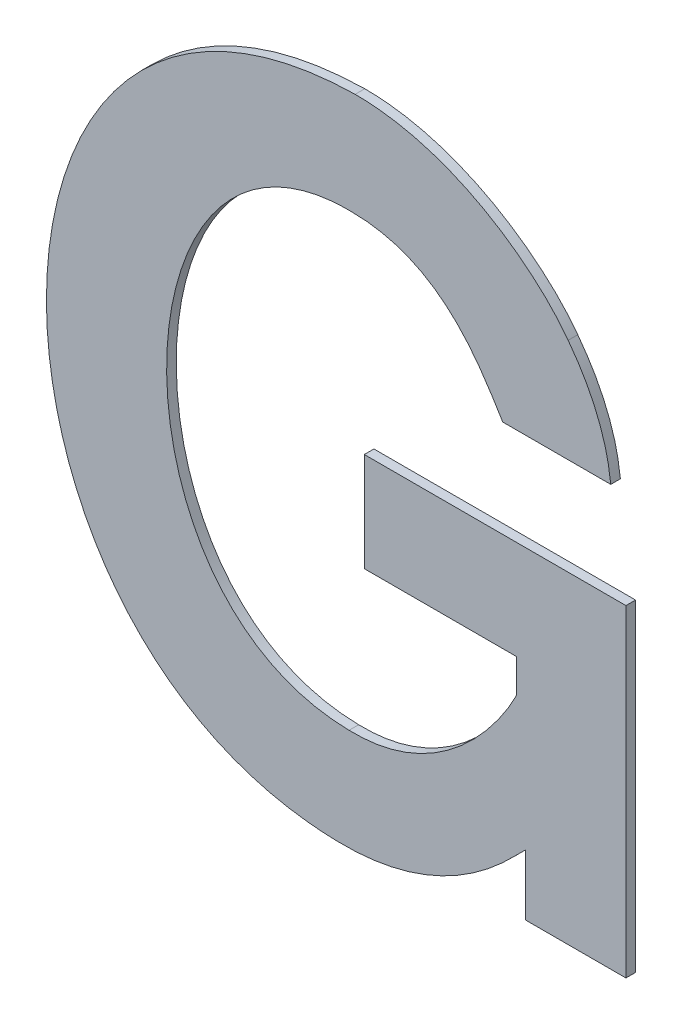
ISO-10303-21;
HEADER;
FILE_DESCRIPTION(('STEP AP214'),'2;1');
FILE_NAME('part.step','',(''),(''),'','','');
FILE_SCHEMA(('AUTOMOTIVE_DESIGN { 1 0 10303 214 1 1 1 1 }'));
ENDSEC;
DATA;
#1=APPLICATION_CONTEXT('core data for automotive mechanical design processes');
#2=APPLICATION_PROTOCOL_DEFINITION('international standard','automotive_design',2000,#1);
#3=PRODUCT_CONTEXT('',#1,'mechanical');
#4=PRODUCT('Part','Part','',(#3));
#5=PRODUCT_RELATED_PRODUCT_CATEGORY('part','',(#4));
#6=PRODUCT_DEFINITION_FORMATION('','',#4);
#7=PRODUCT_DEFINITION_CONTEXT('part definition',#1,'design');
#8=PRODUCT_DEFINITION('design','',#6,#7);
#9=PRODUCT_DEFINITION_SHAPE('','',#8);
#10=(LENGTH_UNIT() NAMED_UNIT(*) SI_UNIT(.MILLI.,.METRE.));
#11=(NAMED_UNIT(*) PLANE_ANGLE_UNIT() SI_UNIT($,.RADIAN.));
#12=(NAMED_UNIT(*) SI_UNIT($,.STERADIAN.) SOLID_ANGLE_UNIT());
#13=UNCERTAINTY_MEASURE_WITH_UNIT(LENGTH_MEASURE(1.E-05),#10,'distance_accuracy_value','');
#14=(GEOMETRIC_REPRESENTATION_CONTEXT(3) GLOBAL_UNCERTAINTY_ASSIGNED_CONTEXT((#13)) GLOBAL_UNIT_ASSIGNED_CONTEXT((#10,
#11,#12)) REPRESENTATION_CONTEXT('',''));
#15=CARTESIAN_POINT('',(0.,0.,0.));
#16=DIRECTION('',(0.,0.,1.));
#17=DIRECTION('',(1.,0.,0.));
#18=AXIS2_PLACEMENT_3D('',#15,#16,#17);
#19=CARTESIAN_POINT('',(3.9241251080488,-0.67256902519454,0.));
#20=DIRECTION('',(1.,0.,0.));
#21=DIRECTION('',(0.,1.,0.));
#22=AXIS2_PLACEMENT_3D('',#19,#20,#21);
#23=PLANE('',#22);
#24=DIRECTION('',(0.,1.,0.));
#25=VECTOR('',#24,1.);
#26=CARTESIAN_POINT('',(3.9241251080488,-0.67256902519454,0.));
#27=LINE('',#26,#25);
#28=CARTESIAN_POINT('',(3.9241251080488,-0.67256902519454,0.));
#29=VERTEX_POINT('',#28);
#30=CARTESIAN_POINT('',(3.9241251080488,-0.571980923701634,0.));
#31=VERTEX_POINT('',#30);
#32=EDGE_CURVE('E11',#29,#31,#27,.T.);
#33=ORIENTED_EDGE('',*,*,#32,.T.);
#34=DIRECTION('',(0.,0.,1.));
#35=VECTOR('',#34,1.);
#36=CARTESIAN_POINT('',(3.9241251080488,-0.571980923701634,0.));
#37=LINE('',#36,#35);
#38=CARTESIAN_POINT('',(3.9241251080488,-0.571980923701634,0.003));
#39=VERTEX_POINT('',#38);
#40=EDGE_CURVE('E24',#31,#39,#37,.T.);
#41=ORIENTED_EDGE('',*,*,#40,.T.);
#42=DIRECTION('',(0.,1.,0.));
#43=VECTOR('',#42,1.);
#44=CARTESIAN_POINT('',(3.9241251080488,-0.67256902519454,0.003));
#45=LINE('',#44,#43);
#46=CARTESIAN_POINT('',(3.9241251080488,-0.67256902519454,0.003));
#47=VERTEX_POINT('',#46);
#48=EDGE_CURVE('E142',#47,#39,#45,.T.);
#49=ORIENTED_EDGE('',*,*,#48,.F.);
#50=DIRECTION('',(0.,0.,1.));
#51=VECTOR('',#50,1.);
#52=CARTESIAN_POINT('',(3.9241251080488,-0.67256902519454,0.));
#53=LINE('',#52,#51);
#54=EDGE_CURVE('E443',#29,#47,#53,.T.);
#55=ORIENTED_EDGE('',*,*,#54,.F.);
#56=EDGE_LOOP('',(#33,#41,#49,#55));
#57=FACE_BOUND('',#56,.T.);
#58=ADVANCED_FACE('F17',(#57),#23,.T.);
#59=CARTESIAN_POINT('',(3.8928272008349,-0.67256902519454,0.));
#60=DIRECTION('',(0.,-1.,0.));
#61=DIRECTION('',(1.,0.,0.));
#62=AXIS2_PLACEMENT_3D('',#59,#60,#61);
#63=PLANE('',#62);
#64=DIRECTION('',(1.,0.,0.));
#65=VECTOR('',#64,1.);
#66=CARTESIAN_POINT('',(3.8928272008349,-0.67256902519454,0.));
#67=LINE('',#66,#65);
#68=CARTESIAN_POINT('',(3.8928272008349,-0.67256902519454,0.));
#69=VERTEX_POINT('',#68);
#70=EDGE_CURVE('E441',#69,#29,#67,.T.);
#71=ORIENTED_EDGE('',*,*,#70,.T.);
#72=ORIENTED_EDGE('',*,*,#54,.T.);
#73=DIRECTION('',(1.,0.,0.));
#74=VECTOR('',#73,1.);
#75=CARTESIAN_POINT('',(3.8928272008349,-0.67256902519454,0.003));
#76=LINE('',#75,#74);
#77=CARTESIAN_POINT('',(3.8928272008349,-0.67256902519454,0.003));
#78=VERTEX_POINT('',#77);
#79=EDGE_CURVE('E439',#78,#47,#76,.T.);
#80=ORIENTED_EDGE('',*,*,#79,.F.);
#81=DIRECTION('',(0.,0.,1.));
#82=VECTOR('',#81,1.);
#83=CARTESIAN_POINT('',(3.8928272008349,-0.67256902519454,0.));
#84=LINE('',#83,#82);
#85=EDGE_CURVE('E436',#69,#78,#84,.T.);
#86=ORIENTED_EDGE('',*,*,#85,.F.);
#87=EDGE_LOOP('',(#71,#72,#80,#86));
#88=FACE_BOUND('',#87,.T.);
#89=ADVANCED_FACE('F248',(#88),#63,.T.);
#90=CARTESIAN_POINT('',(3.8928272008349,-0.653605562588054,0.));
#91=DIRECTION('',(-1.,0.,0.));
#92=DIRECTION('',(0.,-1.,0.));
#93=AXIS2_PLACEMENT_3D('',#90,#91,#92);
#94=PLANE('',#93);
#95=DIRECTION('',(0.,-1.,0.));
#96=VECTOR('',#95,1.);
#97=CARTESIAN_POINT('',(3.8928272008349,-0.653605562588054,0.));
#98=LINE('',#97,#96);
#99=CARTESIAN_POINT('',(3.8928272008349,-0.653605562588054,0.));
#100=VERTEX_POINT('',#99);
#101=EDGE_CURVE('E433',#100,#69,#98,.T.);
#102=ORIENTED_EDGE('',*,*,#101,.T.);
#103=ORIENTED_EDGE('',*,*,#85,.T.);
#104=DIRECTION('',(0.,-1.,0.));
#105=VECTOR('',#104,1.);
#106=CARTESIAN_POINT('',(3.8928272008349,-0.653605562588054,0.003));
#107=LINE('',#106,#105);
#108=CARTESIAN_POINT('',(3.8928272008349,-0.653605562588054,0.003));
#109=VERTEX_POINT('',#108);
#110=EDGE_CURVE('E430',#109,#78,#107,.T.);
#111=ORIENTED_EDGE('',*,*,#110,.F.);
#112=DIRECTION('',(0.,0.,1.));
#113=VECTOR('',#112,1.);
#114=CARTESIAN_POINT('',(3.8928272008349,-0.653605562588054,0.));
#115=LINE('',#114,#113);
#116=EDGE_CURVE('E424',#100,#109,#115,.T.);
#117=ORIENTED_EDGE('',*,*,#116,.F.);
#118=EDGE_LOOP('',(#102,#103,#111,#117));
#119=FACE_BOUND('',#118,.T.);
#120=ADVANCED_FACE('F252',(#119),#94,.T.);
#121=CARTESIAN_POINT('',(3.8339731156285,-0.680639793035438,0.));
#122=CARTESIAN_POINT('',(3.8339731156285,-0.680639793035438,0.003));
#123=CARTESIAN_POINT('',(3.8695621699429,-0.681598433044584,0.));
#124=CARTESIAN_POINT('',(3.8695621699429,-0.681598433044584,0.003));
#125=CARTESIAN_POINT('',(3.8885644712616,-0.65738707719543,0.));
#126=CARTESIAN_POINT('',(3.8885644712616,-0.65738707719543,0.003));
#127=CARTESIAN_POINT('',(3.8928272008349,-0.653605562588054,0.));
#128=CARTESIAN_POINT('',(3.8928272008349,-0.653605562588054,0.003));
#129=B_SPLINE_SURFACE_WITH_KNOTS('',3,1,((#121,#122),(#123,#124),(#125,#126),(#127,#128)),
.UNSPECIFIED.,.F.,.F.,.F.,(4,4),(2,2),(0.,1.),(0.,0.0003),.UNSPECIFIED.);
#130=CARTESIAN_POINT('',(3.8339731156285,-0.680639793035438,0.));
#131=CARTESIAN_POINT('',(3.8695621699429,-0.681598433044584,0.));
#132=CARTESIAN_POINT('',(3.8885644712616,-0.65738707719543,0.));
#133=CARTESIAN_POINT('',(3.8928272008349,-0.653605562588054,0.));
#134=B_SPLINE_CURVE_WITH_KNOTS('',3,(#130,#131,#132,#133),.UNSPECIFIED.,.F.,.F.,(4,4),(0.,1.),.UNSPECIFIED.);
#135=CARTESIAN_POINT('',(3.8339731156285,-0.680639793035438,0.));
#136=VERTEX_POINT('',#135);
#137=EDGE_CURVE('E416',#136,#100,#134,.T.);
#138=CARTESIAN_POINT('',(3.8339731156285,-0.680639793035438,0.003));
#139=CARTESIAN_POINT('',(3.8695621699429,-0.681598433044584,0.003));
#140=CARTESIAN_POINT('',(3.8885644712616,-0.65738707719543,0.003));
#141=CARTESIAN_POINT('',(3.8928272008349,-0.653605562588054,0.003));
#142=B_SPLINE_CURVE_WITH_KNOTS('',3,(#138,#139,#140,#141),.UNSPECIFIED.,.F.,.F.,(4,4),(0.,1.),.UNSPECIFIED.);
#143=CARTESIAN_POINT('',(3.8339731156285,-0.680639793035438,0.003));
#144=VERTEX_POINT('',#143);
#145=EDGE_CURVE('E411',#144,#109,#142,.T.);
#146=DIRECTION('',(0.,0.,1.));
#147=VECTOR('',#146,1.);
#148=CARTESIAN_POINT('',(3.8339731156285,-0.680639793035438,0.));
#149=LINE('',#148,#147);
#150=EDGE_CURVE('E405',#136,#144,#149,.T.);
#151=ORIENTED_EDGE('',*,*,#137,.T.);
#152=ORIENTED_EDGE('',*,*,#116,.T.);
#153=ORIENTED_EDGE('',*,*,#145,.F.);
#154=ORIENTED_EDGE('',*,*,#150,.F.);
#155=EDGE_LOOP('',(#151,#152,#153,#154));
#156=FACE_BOUND('',#155,.T.);
#157=ADVANCED_FACE('F257',(#156),#129,.T.);
#158=CARTESIAN_POINT('',(3.8396851731498,-0.476121610126173,0.));
#159=CARTESIAN_POINT('',(3.8396851731498,-0.476121610126173,0.003));
#160=CARTESIAN_POINT('',(3.7120211581759,-0.478504004094048,0.));
#161=CARTESIAN_POINT('',(3.7120211581759,-0.478504004094048,0.003));
#162=CARTESIAN_POINT('',(3.7125232159527,-0.677794186090077,0.));
#163=CARTESIAN_POINT('',(3.7125232159527,-0.677794186090077,0.003));
#164=CARTESIAN_POINT('',(3.8339731156285,-0.680639793035438,0.));
#165=CARTESIAN_POINT('',(3.8339731156285,-0.680639793035438,0.003));
#166=B_SPLINE_SURFACE_WITH_KNOTS('',3,1,((#158,#159),(#160,#161),(#162,#163),(#164,#165)),
.UNSPECIFIED.,.F.,.F.,.F.,(4,4),(2,2),(0.,1.),(0.,0.0003),.UNSPECIFIED.);
#167=CARTESIAN_POINT('',(3.8396851731498,-0.476121610126173,0.));
#168=CARTESIAN_POINT('',(3.7120211581759,-0.478504004094048,0.));
#169=CARTESIAN_POINT('',(3.7125232159527,-0.677794186090077,0.));
#170=CARTESIAN_POINT('',(3.8339731156285,-0.680639793035438,0.));
#171=B_SPLINE_CURVE_WITH_KNOTS('',3,(#167,#168,#169,#170),.UNSPECIFIED.,.F.,.F.,(4,4),(0.,1.),.UNSPECIFIED.);
#172=CARTESIAN_POINT('',(3.8396851731498,-0.476121610126173,0.));
#173=VERTEX_POINT('',#172);
#174=EDGE_CURVE('E397',#173,#136,#171,.T.);
#175=CARTESIAN_POINT('',(3.8396851731498,-0.476121610126173,0.003));
#176=CARTESIAN_POINT('',(3.7120211581759,-0.478504004094048,0.003));
#177=CARTESIAN_POINT('',(3.7125232159527,-0.677794186090077,0.003));
#178=CARTESIAN_POINT('',(3.8339731156285,-0.680639793035438,0.003));
#179=B_SPLINE_CURVE_WITH_KNOTS('',3,(#175,#176,#177,#178),.UNSPECIFIED.,.F.,.F.,(4,4),(0.,1.),.UNSPECIFIED.);
#180=CARTESIAN_POINT('',(3.8396851731498,-0.476121610126173,0.003));
#181=VERTEX_POINT('',#180);
#182=EDGE_CURVE('E392',#181,#144,#179,.T.);
#183=DIRECTION('',(0.,0.,1.));
#184=VECTOR('',#183,1.);
#185=CARTESIAN_POINT('',(3.8396851731498,-0.476121610126173,0.));
#186=LINE('',#185,#184);
#187=EDGE_CURVE('E386',#173,#181,#186,.T.);
#188=ORIENTED_EDGE('',*,*,#174,.T.);
#189=ORIENTED_EDGE('',*,*,#150,.T.);
#190=ORIENTED_EDGE('',*,*,#182,.F.);
#191=ORIENTED_EDGE('',*,*,#187,.F.);
#192=EDGE_LOOP('',(#188,#189,#190,#191));
#193=FACE_BOUND('',#192,.T.);
#194=ADVANCED_FACE('F266',(#193),#166,.T.);
#195=CARTESIAN_POINT('',(3.9061079713898,-0.509342481978461,0.));
#196=CARTESIAN_POINT('',(3.9061079713898,-0.509342481978461,0.003));
#197=CARTESIAN_POINT('',(3.8961331840857,-0.495584286561103,0.));
#198=CARTESIAN_POINT('',(3.8961331840857,-0.495584286561103,0.003));
#199=CARTESIAN_POINT('',(3.8704999710213,-0.476121610585242,0.));
#200=CARTESIAN_POINT('',(3.8704999710213,-0.476121610585242,0.003));
#201=CARTESIAN_POINT('',(3.8396851731498,-0.476121610126173,0.));
#202=CARTESIAN_POINT('',(3.8396851731498,-0.476121610126173,0.003));
#203=B_SPLINE_SURFACE_WITH_KNOTS('',3,1,((#195,#196),(#197,#198),(#199,#200),(#201,#202)),
.UNSPECIFIED.,.F.,.F.,.F.,(4,4),(2,2),(0.,1.),(0.,0.0003),.UNSPECIFIED.);
#204=CARTESIAN_POINT('',(3.9061079713898,-0.509342481978461,0.));
#205=CARTESIAN_POINT('',(3.8961331840857,-0.495584286561103,0.));
#206=CARTESIAN_POINT('',(3.8704999710213,-0.476121610585242,0.));
#207=CARTESIAN_POINT('',(3.8396851731498,-0.476121610126173,0.));
#208=B_SPLINE_CURVE_WITH_KNOTS('',3,(#204,#205,#206,#207),.UNSPECIFIED.,.F.,.F.,(4,4),(0.,1.),.UNSPECIFIED.);
#209=CARTESIAN_POINT('',(3.9061079713898,-0.509342481978461,0.));
#210=VERTEX_POINT('',#209);
#211=EDGE_CURVE('E378',#210,#173,#208,.T.);
#212=CARTESIAN_POINT('',(3.9061079713898,-0.509342481978461,0.003));
#213=CARTESIAN_POINT('',(3.8961331840857,-0.495584286561103,0.003));
#214=CARTESIAN_POINT('',(3.8704999710213,-0.476121610585242,0.003));
#215=CARTESIAN_POINT('',(3.8396851731498,-0.476121610126173,0.003));
#216=B_SPLINE_CURVE_WITH_KNOTS('',3,(#212,#213,#214,#215),.UNSPECIFIED.,.F.,.F.,(4,4),(0.,1.),.UNSPECIFIED.);
#217=CARTESIAN_POINT('',(3.9061079713898,-0.509342481978461,0.003));
#218=VERTEX_POINT('',#217);
#219=EDGE_CURVE('E373',#218,#181,#216,.T.);
#220=DIRECTION('',(0.,0.,1.));
#221=VECTOR('',#220,1.);
#222=CARTESIAN_POINT('',(3.9061079713898,-0.509342481978461,0.));
#223=LINE('',#222,#221);
#224=EDGE_CURVE('E367',#210,#218,#223,.T.);
#225=ORIENTED_EDGE('',*,*,#211,.T.);
#226=ORIENTED_EDGE('',*,*,#187,.T.);
#227=ORIENTED_EDGE('',*,*,#219,.F.);
#228=ORIENTED_EDGE('',*,*,#224,.F.);
#229=EDGE_LOOP('',(#225,#226,#227,#228));
#230=FACE_BOUND('',#229,.T.);
#231=ADVANCED_FACE('F277',(#230),#203,.T.);
#232=CARTESIAN_POINT('',(3.9193982146769,-0.541623658795568,0.));
#233=CARTESIAN_POINT('',(3.9193982146769,-0.541623658795568,0.003));
#234=CARTESIAN_POINT('',(3.9189245780666,-0.538296835244173,0.));
#235=CARTESIAN_POINT('',(3.9189245780666,-0.538296835244173,0.003));
#236=CARTESIAN_POINT('',(3.9179773048458,-0.525001855590852,0.));
#237=CARTESIAN_POINT('',(3.9179773048458,-0.525001855590852,0.003));
#238=CARTESIAN_POINT('',(3.9061079713898,-0.509342481978461,0.));
#239=CARTESIAN_POINT('',(3.9061079713898,-0.509342481978461,0.003));
#240=B_SPLINE_SURFACE_WITH_KNOTS('',3,1,((#232,#233),(#234,#235),(#236,#237),(#238,#239)),
.UNSPECIFIED.,.F.,.F.,.F.,(4,4),(2,2),(0.,1.),(0.,0.0003),.UNSPECIFIED.);
#241=CARTESIAN_POINT('',(3.9193982146769,-0.541623658795568,0.));
#242=CARTESIAN_POINT('',(3.9189245780666,-0.538296835244173,0.));
#243=CARTESIAN_POINT('',(3.9179773048458,-0.525001855590852,0.));
#244=CARTESIAN_POINT('',(3.9061079713898,-0.509342481978461,0.));
#245=B_SPLINE_CURVE_WITH_KNOTS('',3,(#241,#242,#243,#244),.UNSPECIFIED.,.F.,.F.,(4,4),(0.,1.),.UNSPECIFIED.);
#246=CARTESIAN_POINT('',(3.9193982146769,-0.541623658795568,0.));
#247=VERTEX_POINT('',#246);
#248=EDGE_CURVE('E359',#247,#210,#245,.T.);
#249=CARTESIAN_POINT('',(3.9193982146769,-0.541623658795568,0.003));
#250=CARTESIAN_POINT('',(3.9189245780666,-0.538296835244173,0.003));
#251=CARTESIAN_POINT('',(3.9179773048458,-0.525001855590852,0.003));
#252=CARTESIAN_POINT('',(3.9061079713898,-0.509342481978461,0.003));
#253=B_SPLINE_CURVE_WITH_KNOTS('',3,(#249,#250,#251,#252),.UNSPECIFIED.,.F.,.F.,(4,4),(0.,1.),.UNSPECIFIED.);
#254=CARTESIAN_POINT('',(3.9193982146769,-0.541623658795568,0.003));
#255=VERTEX_POINT('',#254);
#256=EDGE_CURVE('E354',#255,#218,#253,.T.);
#257=DIRECTION('',(0.,0.,1.));
#258=VECTOR('',#257,1.);
#259=CARTESIAN_POINT('',(3.9193982146769,-0.541623658795568,0.));
#260=LINE('',#259,#258);
#261=EDGE_CURVE('E351',#247,#255,#260,.T.);
#262=ORIENTED_EDGE('',*,*,#248,.T.);
#263=ORIENTED_EDGE('',*,*,#224,.T.);
#264=ORIENTED_EDGE('',*,*,#256,.F.);
#265=ORIENTED_EDGE('',*,*,#261,.F.);
#266=EDGE_LOOP('',(#262,#263,#264,#265));
#267=FACE_BOUND('',#266,.T.);
#268=ADVANCED_FACE('F288',(#267),#240,.T.);
#269=CARTESIAN_POINT('',(3.8857037062145,-0.541623658795568,0.));
#270=DIRECTION('',(0.,-1.,0.));
#271=DIRECTION('',(1.,0.,0.));
#272=AXIS2_PLACEMENT_3D('',#269,#270,#271);
#273=PLANE('',#272);
#274=DIRECTION('',(1.,0.,0.));
#275=VECTOR('',#274,1.);
#276=CARTESIAN_POINT('',(3.8857037062145,-0.541623658795568,0.));
#277=LINE('',#276,#275);
#278=CARTESIAN_POINT('',(3.8857037062145,-0.541623658795568,0.));
#279=VERTEX_POINT('',#278);
#280=EDGE_CURVE('E348',#279,#247,#277,.T.);
#281=ORIENTED_EDGE('',*,*,#280,.T.);
#282=ORIENTED_EDGE('',*,*,#261,.T.);
#283=DIRECTION('',(1.,0.,0.));
#284=VECTOR('',#283,1.);
#285=CARTESIAN_POINT('',(3.8857037062145,-0.541623658795568,0.003));
#286=LINE('',#285,#284);
#287=CARTESIAN_POINT('',(3.8857037062145,-0.541623658795568,0.003));
#288=VERTEX_POINT('',#287);
#289=EDGE_CURVE('E334',#288,#255,#286,.T.);
#290=ORIENTED_EDGE('',*,*,#289,.F.);
#291=DIRECTION('',(0.,0.,1.));
#292=VECTOR('',#291,1.);
#293=CARTESIAN_POINT('',(3.8857037062145,-0.541623658795568,0.));
#294=LINE('',#293,#292);
#295=EDGE_CURVE('E327',#279,#288,#294,.T.);
#296=ORIENTED_EDGE('',*,*,#295,.F.);
#297=EDGE_LOOP('',(#281,#282,#290,#296));
#298=FACE_BOUND('',#297,.T.);
#299=ADVANCED_FACE('F299',(#298),#273,.T.);
#300=CARTESIAN_POINT('',(3.838264263319,-0.508398997850769,0.));
#301=CARTESIAN_POINT('',(3.838264263319,-0.508398997850769,0.003));
#302=CARTESIAN_POINT('',(3.8662372348865,-0.508399001741777,0.));
#303=CARTESIAN_POINT('',(3.8662372348865,-0.508399001741777,0.003));
#304=CARTESIAN_POINT('',(3.8781065725132,-0.529264586603008,0.));
#305=CARTESIAN_POINT('',(3.8781065725132,-0.529264586603008,0.003));
#306=CARTESIAN_POINT('',(3.8857037062145,-0.541623658795568,0.));
#307=CARTESIAN_POINT('',(3.8857037062145,-0.541623658795568,0.003));
#308=B_SPLINE_SURFACE_WITH_KNOTS('',3,1,((#300,#301),(#302,#303),(#304,#305),(#306,#307)),
.UNSPECIFIED.,.F.,.F.,.F.,(4,4),(2,2),(0.,1.),(0.,0.0003),.UNSPECIFIED.);
#309=CARTESIAN_POINT('',(3.838264263319,-0.508398997850769,0.));
#310=CARTESIAN_POINT('',(3.8662372348865,-0.508399001741777,0.));
#311=CARTESIAN_POINT('',(3.8781065725132,-0.529264586603008,0.));
#312=CARTESIAN_POINT('',(3.8857037062145,-0.541623658795568,0.));
#313=B_SPLINE_CURVE_WITH_KNOTS('',3,(#309,#310,#311,#312),.UNSPECIFIED.,.F.,.F.,(4,4),(0.,1.),.UNSPECIFIED.);
#314=CARTESIAN_POINT('',(3.838264263319,-0.508398997850769,0.));
#315=VERTEX_POINT('',#314);
#316=EDGE_CURVE('E325',#315,#279,#313,.T.);
#317=CARTESIAN_POINT('',(3.838264263319,-0.508398997850769,0.003));
#318=CARTESIAN_POINT('',(3.8662372348865,-0.508399001741777,0.003));
#319=CARTESIAN_POINT('',(3.8781065725132,-0.529264586603008,0.003));
#320=CARTESIAN_POINT('',(3.8857037062145,-0.541623658795568,0.003));
#321=B_SPLINE_CURVE_WITH_KNOTS('',3,(#317,#318,#319,#320),.UNSPECIFIED.,.F.,.F.,(4,4),(0.,1.),.UNSPECIFIED.);
#322=CARTESIAN_POINT('',(3.838264263319,-0.508398997850769,0.003));
#323=VERTEX_POINT('',#322);
#324=EDGE_CURVE('E332',#323,#288,#321,.T.);
#325=DIRECTION('',(0.,0.,1.));
#326=VECTOR('',#325,1.);
#327=CARTESIAN_POINT('',(3.838264263319,-0.508398997850769,0.));
#328=LINE('',#327,#326);
#329=EDGE_CURVE('E330',#315,#323,#328,.T.);
#330=ORIENTED_EDGE('',*,*,#316,.T.);
#331=ORIENTED_EDGE('',*,*,#295,.T.);
#332=ORIENTED_EDGE('',*,*,#324,.F.);
#333=ORIENTED_EDGE('',*,*,#329,.F.);
#334=EDGE_LOOP('',(#330,#331,#332,#333));
#335=FACE_BOUND('',#334,.T.);
#336=ADVANCED_FACE('F307',(#335),#308,.T.);
#337=CARTESIAN_POINT('',(3.8377811539761,-0.648839831014305,0.));
#338=CARTESIAN_POINT('',(3.8377811539761,-0.648839831014305,0.003));
#339=CARTESIAN_POINT('',(3.759498495012,-0.647436919374461,0.));
#340=CARTESIAN_POINT('',(3.759498495012,-0.647436919374461,0.003));
#341=CARTESIAN_POINT('',(3.7642253883836,-0.50745930281569,0.));
#342=CARTESIAN_POINT('',(3.7642253883836,-0.50745930281569,0.003));
#343=CARTESIAN_POINT('',(3.838264263319,-0.508398997850769,0.));
#344=CARTESIAN_POINT('',(3.838264263319,-0.508398997850769,0.003));
#345=B_SPLINE_SURFACE_WITH_KNOTS('',3,1,((#337,#338),(#339,#340),(#341,#342),(#343,#344)),
.UNSPECIFIED.,.F.,.F.,.F.,(4,4),(2,2),(0.,1.),(0.,0.0003),.UNSPECIFIED.);
#346=CARTESIAN_POINT('',(3.8377811539761,-0.648839831014305,0.));
#347=CARTESIAN_POINT('',(3.759498495012,-0.647436919374461,0.));
#348=CARTESIAN_POINT('',(3.7642253883836,-0.50745930281569,0.));
#349=CARTESIAN_POINT('',(3.838264263319,-0.508398997850769,0.));
#350=B_SPLINE_CURVE_WITH_KNOTS('',3,(#346,#347,#348,#349),.UNSPECIFIED.,.F.,.F.,(4,4),(0.,1.),.UNSPECIFIED.);
#351=CARTESIAN_POINT('',(3.8377811539761,-0.648839831014305,0.));
#352=VERTEX_POINT('',#351);
#353=EDGE_CURVE('E454',#352,#315,#350,.T.);
#354=CARTESIAN_POINT('',(3.8377811539761,-0.648839831014305,0.003));
#355=CARTESIAN_POINT('',(3.759498495012,-0.647436919374461,0.003));
#356=CARTESIAN_POINT('',(3.7642253883836,-0.50745930281569,0.003));
#357=CARTESIAN_POINT('',(3.838264263319,-0.508398997850769,0.003));
#358=B_SPLINE_CURVE_WITH_KNOTS('',3,(#354,#355,#356,#357),.UNSPECIFIED.,.F.,.F.,(4,4),(0.,1.),.UNSPECIFIED.);
#359=CARTESIAN_POINT('',(3.8377811539761,-0.648839831014305,0.003));
#360=VERTEX_POINT('',#359);
#361=EDGE_CURVE('E451',#360,#323,#358,.T.);
#362=DIRECTION('',(0.,0.,1.));
#363=VECTOR('',#362,1.);
#364=CARTESIAN_POINT('',(3.8377811539761,-0.648839831014305,0.));
#365=LINE('',#364,#363);
#366=EDGE_CURVE('E450',#352,#360,#365,.T.);
#367=ORIENTED_EDGE('',*,*,#353,.T.);
#368=ORIENTED_EDGE('',*,*,#329,.T.);
#369=ORIENTED_EDGE('',*,*,#361,.F.);
#370=ORIENTED_EDGE('',*,*,#366,.F.);
#371=EDGE_LOOP('',(#367,#368,#369,#370));
#372=FACE_BOUND('',#371,.T.);
#373=ADVANCED_FACE('F186',(#372),#345,.T.);
#374=CARTESIAN_POINT('',(3.8899664357081,-0.6132725633945,0.));
#375=CARTESIAN_POINT('',(3.8899664357081,-0.6132725633945,0.003));
#376=CARTESIAN_POINT('',(3.8899664349685,-0.613734831626328,0.));
#377=CARTESIAN_POINT('',(3.8899664349685,-0.613734831626328,0.003));
#378=CARTESIAN_POINT('',(3.8724229356794,-0.649779525319505,0.));
#379=CARTESIAN_POINT('',(3.8724229356794,-0.649779525319505,0.003));
#380=CARTESIAN_POINT('',(3.8377811539761,-0.648839831014305,0.));
#381=CARTESIAN_POINT('',(3.8377811539761,-0.648839831014305,0.003));
#382=B_SPLINE_SURFACE_WITH_KNOTS('',3,1,((#374,#375),(#376,#377),(#378,#379),(#380,#381)),
.UNSPECIFIED.,.F.,.F.,.F.,(4,4),(2,2),(0.,1.),(0.,0.0003),.UNSPECIFIED.);
#383=CARTESIAN_POINT('',(3.8899664357081,-0.6132725633945,0.));
#384=CARTESIAN_POINT('',(3.8899664349685,-0.613734831626328,0.));
#385=CARTESIAN_POINT('',(3.8724229356794,-0.649779525319505,0.));
#386=CARTESIAN_POINT('',(3.8377811539761,-0.648839831014305,0.));
#387=B_SPLINE_CURVE_WITH_KNOTS('',3,(#383,#384,#385,#386),.UNSPECIFIED.,.F.,.F.,(4,4),(0.,1.),.UNSPECIFIED.);
#388=CARTESIAN_POINT('',(3.8899664357081,-0.6132725633945,0.));
#389=VERTEX_POINT('',#388);
#390=EDGE_CURVE('E449',#389,#352,#387,.T.);
#391=CARTESIAN_POINT('',(3.8377811539761,-0.648839831014305,0.003));
#392=CARTESIAN_POINT('',(3.83832162419503,-0.64885450388253,0.003));
#393=CARTESIAN_POINT('',(3.83886234507864,-0.648860270268998,0.003));
#394=CARTESIAN_POINT('',(3.83993531771345,-0.648853790890429,0.003));
#395=CARTESIAN_POINT('',(3.84046757117157,-0.648841822187544,0.003));
#396=CARTESIAN_POINT('',(3.84152360166269,-0.6488004430278,0.003));
#397=CARTESIAN_POINT('',(3.84204738875563,-0.648771290376417,0.003));
#398=CARTESIAN_POINT('',(3.84308647343301,-0.64869613145206,0.003));
#399=CARTESIAN_POINT('',(3.84360178826583,-0.648650363773942,0.003));
#400=CARTESIAN_POINT('',(3.84462391851586,-0.648542557837894,0.003));
#401=CARTESIAN_POINT('',(3.84513075712822,-0.648480739574115,0.003));
#402=CARTESIAN_POINT('',(3.84613592577333,-0.648341416105947,0.003));
#403=CARTESIAN_POINT('',(3.84663428382237,-0.648264113027729,0.003));
#404=CARTESIAN_POINT('',(3.84762248348461,-0.648094402396741,0.003));
#405=CARTESIAN_POINT('',(3.84811235690602,-0.648002180030977,0.003));
#406=CARTESIAN_POINT('',(3.84908358034094,-0.647803212435513,0.003));
#407=CARTESIAN_POINT('',(3.84956496505039,-0.647696636518219,0.003));
#408=CARTESIAN_POINT('',(3.85051920542742,-0.647469542046353,0.003));
#409=CARTESIAN_POINT('',(3.8509920978999,-0.647349178104744,0.003));
#410=CARTESIAN_POINT('',(3.85192934737172,-0.647095087422404,0.003));
#411=CARTESIAN_POINT('',(3.85239374266231,-0.64696150183008,0.003));
#412=CARTESIAN_POINT('',(3.85331399770522,-0.646681543320511,0.003));
#413=CARTESIAN_POINT('',(3.85376989667805,-0.646535299395976,0.003));
#414=CARTESIAN_POINT('',(3.85467313838145,-0.646230609689173,0.003));
#415=CARTESIAN_POINT('',(3.85512052107665,-0.646072281928248,0.003));
#416=CARTESIAN_POINT('',(3.85644441744408,-0.6455818483954,0.003));
#417=CARTESIAN_POINT('',(3.85731400574236,-0.645230830017218,0.003));
#418=CARTESIAN_POINT('',(3.85901867661261,-0.644486471809964,0.003));
#419=CARTESIAN_POINT('',(3.85985408557104,-0.644093875607118,0.003));
#420=CARTESIAN_POINT('',(3.86149045456458,-0.643270970987756,0.003));
#421=CARTESIAN_POINT('',(3.86229174308765,-0.642841315122378,0.003));
#422=CARTESIAN_POINT('',(3.8638598278785,-0.641948894853082,0.003));
#423=CARTESIAN_POINT('',(3.8646269604141,-0.641486720139144,0.003));
#424=CARTESIAN_POINT('',(3.86612671020062,-0.640533830889018,0.003));
#425=CARTESIAN_POINT('',(3.86685967715062,-0.640043665856188,0.003));
#426=CARTESIAN_POINT('',(3.86829105911554,-0.639039345434296,0.003));
#427=CARTESIAN_POINT('',(3.86898984386657,-0.638525716174114,0.003));
#428=CARTESIAN_POINT('',(3.87035281949549,-0.637479000771722,0.003));
#429=CARTESIAN_POINT('',(3.87101740615467,-0.6369464292594,0.003));
#430=CARTESIAN_POINT('',(3.87231193657009,-0.635866352505238,0.003));
#431=CARTESIAN_POINT('',(3.87294230717811,-0.635319358196604,0.003));
#432=CARTESIAN_POINT('',(3.8741683519314,-0.634214951790947,0.003));
#433=CARTESIAN_POINT('',(3.87476448773002,-0.63365805160934,0.003));
#434=CARTESIAN_POINT('',(3.8759220028856,-0.63253834732953,0.003));
#435=CARTESIAN_POINT('',(3.8764838812139,-0.631976058451054,0.003));
#436=CARTESIAN_POINT('',(3.87757282736968,-0.630850082899646,0.003));
#437=CARTESIAN_POINT('',(3.87810043253727,-0.630286915679318,0.003));
#438=CARTESIAN_POINT('',(3.87912074603307,-0.629163711090943,0.003));
#439=CARTESIAN_POINT('',(3.87961403134995,-0.628604196449632,0.003));
#440=CARTESIAN_POINT('',(3.8810117610623,-0.626971842953202,0.003));
#441=CARTESIAN_POINT('',(3.88189547661987,-0.625881132964741,0.003));
#442=CARTESIAN_POINT('',(3.88351999682359,-0.623764628696312,0.003));
#443=CARTESIAN_POINT('',(3.88426630110996,-0.622743037223188,0.003));
#444=CARTESIAN_POINT('',(3.88561542386257,-0.620800769731535,0.003));
#445=CARTESIAN_POINT('',(3.88622426899531,-0.619884284933722,0.003));
#446=CARTESIAN_POINT('',(3.88729755377554,-0.618188297952009,0.003));
#447=CARTESIAN_POINT('',(3.88776858936323,-0.617412968990418,0.003));
#448=CARTESIAN_POINT('',(3.88856612718443,-0.616035618332856,0.003));
#449=CARTESIAN_POINT('',(3.88889973461795,-0.615437751010157,0.003));
#450=CARTESIAN_POINT('',(3.88933531496409,-0.614611889992224,0.003));
#451=CARTESIAN_POINT('',(3.88944969103044,-0.614390437955037,0.003));
#452=CARTESIAN_POINT('',(3.88964278914178,-0.614004796305267,0.003));
#453=CARTESIAN_POINT('',(3.88972280895074,-0.613841267740646,0.003));
#454=CARTESIAN_POINT('',(3.88982685377018,-0.613617677739214,0.003));
#455=CARTESIAN_POINT('',(3.88985369611407,-0.61355893261762,0.003));
#456=CARTESIAN_POINT('',(3.88989846497557,-0.61345746405365,0.003));
#457=CARTESIAN_POINT('',(3.88991676546021,-0.613414909764161,0.003));
#458=CARTESIAN_POINT('',(3.8899399053229,-0.613356874559927,0.003));
#459=CARTESIAN_POINT('',(3.88994575138276,-0.613341805437208,0.003));
#460=CARTESIAN_POINT('',(3.8899533791894,-0.613320671318578,0.003));
#461=CARTESIAN_POINT('',(3.88995546599301,-0.613314717525462,0.003));
#462=CARTESIAN_POINT('',(3.88995907234825,-0.613303870592892,0.003));
#463=CARTESIAN_POINT('',(3.88996062474634,-0.613298988703051,0.003));
#464=CARTESIAN_POINT('',(3.88996263655835,-0.613292037332917,0.003));
#465=CARTESIAN_POINT('',(3.88996320266717,-0.61328999903028,0.003));
#466=CARTESIAN_POINT('',(3.88996419161854,-0.61328619097855,0.003));
#467=CARTESIAN_POINT('',(3.88996462342082,-0.613284423618365,0.003));
#468=CARTESIAN_POINT('',(3.88996518481493,-0.613281866837486,0.003));
#469=CARTESIAN_POINT('',(3.88996534807886,-0.613281084856605,0.003));
#470=CARTESIAN_POINT('',(3.88996563893902,-0.613279588667091,0.003));
#471=CARTESIAN_POINT('',(3.88996576843409,-0.613278874832374,0.003));
#472=CARTESIAN_POINT('',(3.88996599139937,-0.61327751504261,0.003));
#473=CARTESIAN_POINT('',(3.88996608718199,-0.613276869474374,0.003));
#474=CARTESIAN_POINT('',(3.88996624254797,-0.613275646393016,0.003));
#475=CARTESIAN_POINT('',(3.88996630496317,-0.613275069249086,0.003));
#476=CARTESIAN_POINT('',(3.8899663919661,-0.613273982921554,0.003));
#477=CARTESIAN_POINT('',(3.88996642024999,-0.613273474070029,0.003));
#478=CARTESIAN_POINT('',(3.88996644156561,-0.613272507814145,0.003));
#479=CARTESIAN_POINT('',(3.88996643790201,-0.613272050461964,0.003));
#480=CARTESIAN_POINT('',(3.88996643135236,-0.613270684221474,0.003));
#481=CARTESIAN_POINT('',(3.88996643280673,-0.613269775429144,0.003));
#482=CARTESIAN_POINT('',(3.88996644152859,-0.61326704914854,0.003));
#483=CARTESIAN_POINT('',(3.88996645315482,-0.613265231756651,0.003));
#484=CARTESIAN_POINT('',(3.88996643572274,-0.613263413722194,0.003));
#485=B_SPLINE_CURVE_WITH_KNOTS('',3,(#391,#392,#393,#394,#395,#396,#397,#398,#399,#400,#401,
#402,#403,#404,#405,#406,#407,#408,#409,#410,#411,#412,#413,#414,#415,#416,#417,#418,#419,#420,
#421,#422,#423,#424,#425,#426,#427,#428,#429,#430,#431,#432,#433,#434,#435,#436,#437,#438,#439,
#440,#441,#442,#443,#444,#445,#446,#447,#448,#449,#450,#451,#452,#453,#454,#455,#456,#457,#458,
#459,#460,#461,#462,#463,#464,#465,#466,#467,#468,#469,#470,#471,#472,#473,#474,#475,#476,#477,
#478,#479,#480,#481,#482,#483,#484),.UNSPECIFIED.,.F.,.F.,(4,2,2,2,2,2,2,2,2,2,2,2,2,2,2,2,2,2,
2,2,2,2,2,2,2,2,2,2,2,2,2,2,2,2,2,2,2,2,2,2,2,2,2,2,2,2,4),(0.,0.00162194727532044,
0.00321882174474141,0.0047923275799039,0.00634407777481643,0.0078755892926087,
0.00938827885522832,0.0108834594302006,0.0123623374501277,0.0138260107817498,0.015275467443012,
0.0167115850494661,0.0181351309562582,0.0209467462007094,0.0237146064744002,0.0264410308650061,
0.0291267730598473,0.0317711309212138,0.0343720650821853,0.0369263202841064,0.0394295446742264,
0.0418764037037618,0.044260686487959,0.0465754034621907,0.0488128748939972,0.053022003903504,
0.056816122411612,0.060115962943351,0.0628369368565484,0.0648902787598846,0.0656379773230778,
0.0661840609586018,0.0663778158089582,0.0665167554733429,0.0665652355675028,0.0665841609064263,
0.0665995247241823,0.0666058704327606,0.0666113269936129,0.0666137233008765,0.0666158994544356,
0.0666178569388738,0.0666195979448012,0.0666211257616692,0.0666224975751212,0.0666252240484958,
0.066630676995245),.UNSPECIFIED.);
#486=CARTESIAN_POINT('',(3.8899664357081,-0.6132725633945,0.003));
#487=VERTEX_POINT('',#486);
#488=EDGE_CURVE('E219',#487,#360,#485,.F.);
#489=CARTESIAN_POINT('',(3.88996643572274,-0.613263413722194,0.003));
#490=CARTESIAN_POINT('',(3.88996643572274,-0.613263413722194,0.002875));
#491=CARTESIAN_POINT('',(3.88996643572274,-0.613263413722194,0.00275));
#492=CARTESIAN_POINT('',(3.88996643572274,-0.613263413722194,0.0025));
#493=CARTESIAN_POINT('',(3.88996643572274,-0.613263413722194,0.002375));
#494=CARTESIAN_POINT('',(3.88996643572274,-0.613263413722194,0.002125));
#495=CARTESIAN_POINT('',(3.88996643572274,-0.613263413722194,0.002));
#496=CARTESIAN_POINT('',(3.88996643572274,-0.613263413722194,0.00175));
#497=CARTESIAN_POINT('',(3.88996643572274,-0.613263413722194,0.001625));
#498=CARTESIAN_POINT('',(3.88996643572274,-0.613263413722194,0.001375));
#499=CARTESIAN_POINT('',(3.88996643572274,-0.613263413722194,0.00125));
#500=CARTESIAN_POINT('',(3.88996643572274,-0.613263413722194,0.001));
#501=CARTESIAN_POINT('',(3.88996643572274,-0.613263413722194,0.000875));
#502=CARTESIAN_POINT('',(3.88996643572274,-0.613263413722194,0.000625));
#503=CARTESIAN_POINT('',(3.88996643572274,-0.613263413722194,0.0005));
#504=CARTESIAN_POINT('',(3.88996643572274,-0.613263413722194,0.00025));
#505=CARTESIAN_POINT('',(3.88996643572274,-0.613263413722194,0.000125));
#506=CARTESIAN_POINT('',(3.88996643572274,-0.613263413722194,0.));
#507=B_SPLINE_CURVE_WITH_KNOTS('',3,(#489,#490,#491,#492,#493,#494,#495,#496,#497,#498,#499,
#500,#501,#502,#503,#504,#505,#506),.UNSPECIFIED.,.F.,.F.,(4,2,2,2,2,2,2,2,4),(0.,0.000375,
0.00075,0.001125,0.0015,0.001875,0.00225,0.002625,0.003),.UNSPECIFIED.);
#508=EDGE_CURVE('E166',#389,#487,#507,.F.);
#509=ORIENTED_EDGE('',*,*,#390,.T.);
#510=ORIENTED_EDGE('',*,*,#366,.T.);
#511=ORIENTED_EDGE('',*,*,#488,.F.);
#512=ORIENTED_EDGE('',*,*,#508,.F.);
#513=EDGE_LOOP('',(#509,#510,#511,#512));
#514=FACE_BOUND('',#513,.T.);
#515=ADVANCED_FACE('F173',(#514),#382,.T.);
#516=CARTESIAN_POINT('',(3.8899664357081,-0.602819403403348,0.));
#517=DIRECTION('',(-1.,0.,0.));
#518=DIRECTION('',(0.,-1.,0.));
#519=AXIS2_PLACEMENT_3D('',#516,#517,#518);
#520=PLANE('',#519);
#521=DIRECTION('',(0.,-1.,0.));
#522=VECTOR('',#521,1.);
#523=CARTESIAN_POINT('',(3.8899664357081,-0.602819403403348,0.));
#524=LINE('',#523,#522);
#525=CARTESIAN_POINT('',(3.8899664357081,-0.602819403403348,0.));
#526=VERTEX_POINT('',#525);
#527=EDGE_CURVE('E161',#526,#389,#524,.T.);
#528=ORIENTED_EDGE('',*,*,#527,.T.);
#529=ORIENTED_EDGE('',*,*,#508,.T.);
#530=DIRECTION('',(0.,-1.,0.));
#531=VECTOR('',#530,1.);
#532=CARTESIAN_POINT('',(3.8899664357081,-0.602819403403348,0.003));
#533=LINE('',#532,#531);
#534=CARTESIAN_POINT('',(3.8899664357081,-0.602819403403348,0.003));
#535=VERTEX_POINT('',#534);
#536=EDGE_CURVE('E156',#535,#487,#533,.T.);
#537=ORIENTED_EDGE('',*,*,#536,.F.);
#538=DIRECTION('',(0.,0.,1.));
#539=VECTOR('',#538,1.);
#540=CARTESIAN_POINT('',(3.8899664357081,-0.602819403403348,0.));
#541=LINE('',#540,#539);
#542=EDGE_CURVE('E153',#526,#535,#541,.T.);
#543=ORIENTED_EDGE('',*,*,#542,.F.);
#544=EDGE_LOOP('',(#528,#529,#537,#543));
#545=FACE_BOUND('',#544,.T.);
#546=ADVANCED_FACE('F185',(#545),#520,.T.);
#547=CARTESIAN_POINT('',(3.842526992812,-0.602819403403348,0.));
#548=DIRECTION('',(0.,-1.,0.));
#549=DIRECTION('',(1.,0.,0.));
#550=AXIS2_PLACEMENT_3D('',#547,#548,#549);
#551=PLANE('',#550);
#552=DIRECTION('',(1.,0.,0.));
#553=VECTOR('',#552,1.);
#554=CARTESIAN_POINT('',(3.842526992812,-0.602819403403348,0.));
#555=LINE('',#554,#553);
#556=CARTESIAN_POINT('',(3.842526992812,-0.602819403403348,0.));
#557=VERTEX_POINT('',#556);
#558=EDGE_CURVE('E150',#557,#526,#555,.T.);
#559=ORIENTED_EDGE('',*,*,#558,.T.);
#560=ORIENTED_EDGE('',*,*,#542,.T.);
#561=DIRECTION('',(1.,0.,0.));
#562=VECTOR('',#561,1.);
#563=CARTESIAN_POINT('',(3.842526992812,-0.602819403403348,0.003));
#564=LINE('',#563,#562);
#565=CARTESIAN_POINT('',(3.842526992812,-0.602819403403348,0.003));
#566=VERTEX_POINT('',#565);
#567=EDGE_CURVE('E148',#566,#535,#564,.T.);
#568=ORIENTED_EDGE('',*,*,#567,.F.);
#569=DIRECTION('',(0.,0.,1.));
#570=VECTOR('',#569,1.);
#571=CARTESIAN_POINT('',(3.842526992812,-0.602819403403348,0.));
#572=LINE('',#571,#570);
#573=EDGE_CURVE('E127',#557,#566,#572,.T.);
#574=ORIENTED_EDGE('',*,*,#573,.F.);
#575=EDGE_LOOP('',(#559,#560,#568,#574));
#576=FACE_BOUND('',#575,.T.);
#577=ADVANCED_FACE('F239',(#576),#551,.T.);
#578=CARTESIAN_POINT('',(3.842526992812,-0.571980923701634,0.));
#579=DIRECTION('',(-1.,0.,0.));
#580=DIRECTION('',(0.,-1.,0.));
#581=AXIS2_PLACEMENT_3D('',#578,#579,#580);
#582=PLANE('',#581);
#583=DIRECTION('',(0.,-1.,0.));
#584=VECTOR('',#583,1.);
#585=CARTESIAN_POINT('',(3.842526992812,-0.571980923701634,0.));
#586=LINE('',#585,#584);
#587=CARTESIAN_POINT('',(3.842526992812,-0.571980923701634,0.));
#588=VERTEX_POINT('',#587);
#589=EDGE_CURVE('E131',#588,#557,#586,.T.);
#590=ORIENTED_EDGE('',*,*,#589,.T.);
#591=ORIENTED_EDGE('',*,*,#573,.T.);
#592=DIRECTION('',(0.,-1.,0.));
#593=VECTOR('',#592,1.);
#594=CARTESIAN_POINT('',(3.842526992812,-0.571980923701634,0.003));
#595=LINE('',#594,#593);
#596=CARTESIAN_POINT('',(3.842526992812,-0.571980923701634,0.003));
#597=VERTEX_POINT('',#596);
#598=EDGE_CURVE('E120',#597,#566,#595,.T.);
#599=ORIENTED_EDGE('',*,*,#598,.F.);
#600=DIRECTION('',(0.,0.,1.));
#601=VECTOR('',#600,1.);
#602=CARTESIAN_POINT('',(3.842526992812,-0.571980923701634,0.));
#603=LINE('',#602,#601);
#604=EDGE_CURVE('E124',#588,#597,#603,.T.);
#605=ORIENTED_EDGE('',*,*,#604,.F.);
#606=EDGE_LOOP('',(#590,#591,#599,#605));
#607=FACE_BOUND('',#606,.T.);
#608=ADVANCED_FACE('F123',(#607),#582,.T.);
#609=CARTESIAN_POINT('',(3.9241251080488,-0.571980923701634,0.));
#610=DIRECTION('',(0.,1.,0.));
#611=DIRECTION('',(-1.,0.,0.));
#612=AXIS2_PLACEMENT_3D('',#609,#610,#611);
#613=PLANE('',#612);
#614=DIRECTION('',(-1.,0.,0.));
#615=VECTOR('',#614,1.);
#616=CARTESIAN_POINT('',(3.9241251080488,-0.571980923701634,0.));
#617=LINE('',#616,#615);
#618=EDGE_CURVE('E137',#31,#588,#617,.T.);
#619=ORIENTED_EDGE('',*,*,#618,.T.);
#620=ORIENTED_EDGE('',*,*,#604,.T.);
#621=DIRECTION('',(-1.,0.,0.));
#622=VECTOR('',#621,1.);
#623=CARTESIAN_POINT('',(3.9241251080488,-0.571980923701634,0.003));
#624=LINE('',#623,#622);
#625=EDGE_CURVE('E136',#39,#597,#624,.T.);
#626=ORIENTED_EDGE('',*,*,#625,.F.);
#627=ORIENTED_EDGE('',*,*,#40,.F.);
#628=EDGE_LOOP('',(#619,#620,#626,#627));
#629=FACE_BOUND('',#628,.T.);
#630=ADVANCED_FACE('F135',(#629),#613,.T.);
#631=CARTESIAN_POINT('',(3.8180731331123,-0.578860021585379,0.003));
#632=DIRECTION('',(0.,0.,1.));
#633=DIRECTION('',(1.,0.,0.));
#634=AXIS2_PLACEMENT_3D('',#631,#632,#633);
#635=PLANE('',#634);
#636=ORIENTED_EDGE('',*,*,#625,.T.);
#637=ORIENTED_EDGE('',*,*,#598,.T.);
#638=ORIENTED_EDGE('',*,*,#567,.T.);
#639=ORIENTED_EDGE('',*,*,#536,.T.);
#640=ORIENTED_EDGE('',*,*,#488,.T.);
#641=ORIENTED_EDGE('',*,*,#361,.T.);
#642=ORIENTED_EDGE('',*,*,#324,.T.);
#643=ORIENTED_EDGE('',*,*,#289,.T.);
#644=ORIENTED_EDGE('',*,*,#256,.T.);
#645=ORIENTED_EDGE('',*,*,#219,.T.);
#646=ORIENTED_EDGE('',*,*,#182,.T.);
#647=ORIENTED_EDGE('',*,*,#145,.T.);
#648=ORIENTED_EDGE('',*,*,#110,.T.);
#649=ORIENTED_EDGE('',*,*,#79,.T.);
#650=ORIENTED_EDGE('',*,*,#48,.T.);
#651=EDGE_LOOP('',(#636,#637,#638,#639,#640,#641,#642,#643,#644,#645,#646,#647,#648,#649,#650));
#652=FACE_BOUND('',#651,.T.);
#653=ADVANCED_FACE('F140',(#652),#635,.T.);
#654=CARTESIAN_POINT('',(3.8180731331123,-0.578860021585379,0.));
#655=DIRECTION('',(0.,0.,1.));
#656=DIRECTION('',(1.,0.,0.));
#657=AXIS2_PLACEMENT_3D('',#654,#655,#656);
#658=PLANE('',#657);
#659=ORIENTED_EDGE('',*,*,#618,.F.);
#660=ORIENTED_EDGE('',*,*,#32,.F.);
#661=ORIENTED_EDGE('',*,*,#70,.F.);
#662=ORIENTED_EDGE('',*,*,#101,.F.);
#663=ORIENTED_EDGE('',*,*,#137,.F.);
#664=ORIENTED_EDGE('',*,*,#174,.F.);
#665=ORIENTED_EDGE('',*,*,#211,.F.);
#666=ORIENTED_EDGE('',*,*,#248,.F.);
#667=ORIENTED_EDGE('',*,*,#280,.F.);
#668=ORIENTED_EDGE('',*,*,#316,.F.);
#669=ORIENTED_EDGE('',*,*,#353,.F.);
#670=ORIENTED_EDGE('',*,*,#390,.F.);
#671=ORIENTED_EDGE('',*,*,#527,.F.);
#672=ORIENTED_EDGE('',*,*,#558,.F.);
#673=ORIENTED_EDGE('',*,*,#589,.F.);
#674=EDGE_LOOP('',(#659,#660,#661,#662,#663,#664,#665,#666,#667,#668,#669,#670,#671,#672,#673));
#675=FACE_BOUND('',#674,.T.);
#676=ADVANCED_FACE('F234',(#675),#658,.F.);
#677=CLOSED_SHELL('',(#58,#89,#120,#157,#194,#231,#268,#299,#336,#373,#515,#546,#577,#608,#630,
#653,#676));
#678=MANIFOLD_SOLID_BREP('B1',#677);
#679=ADVANCED_BREP_SHAPE_REPRESENTATION('',(#18,#678),#14);
#680=SHAPE_DEFINITION_REPRESENTATION(#9,#679);
ENDSEC;
END-ISO-10303-21;
